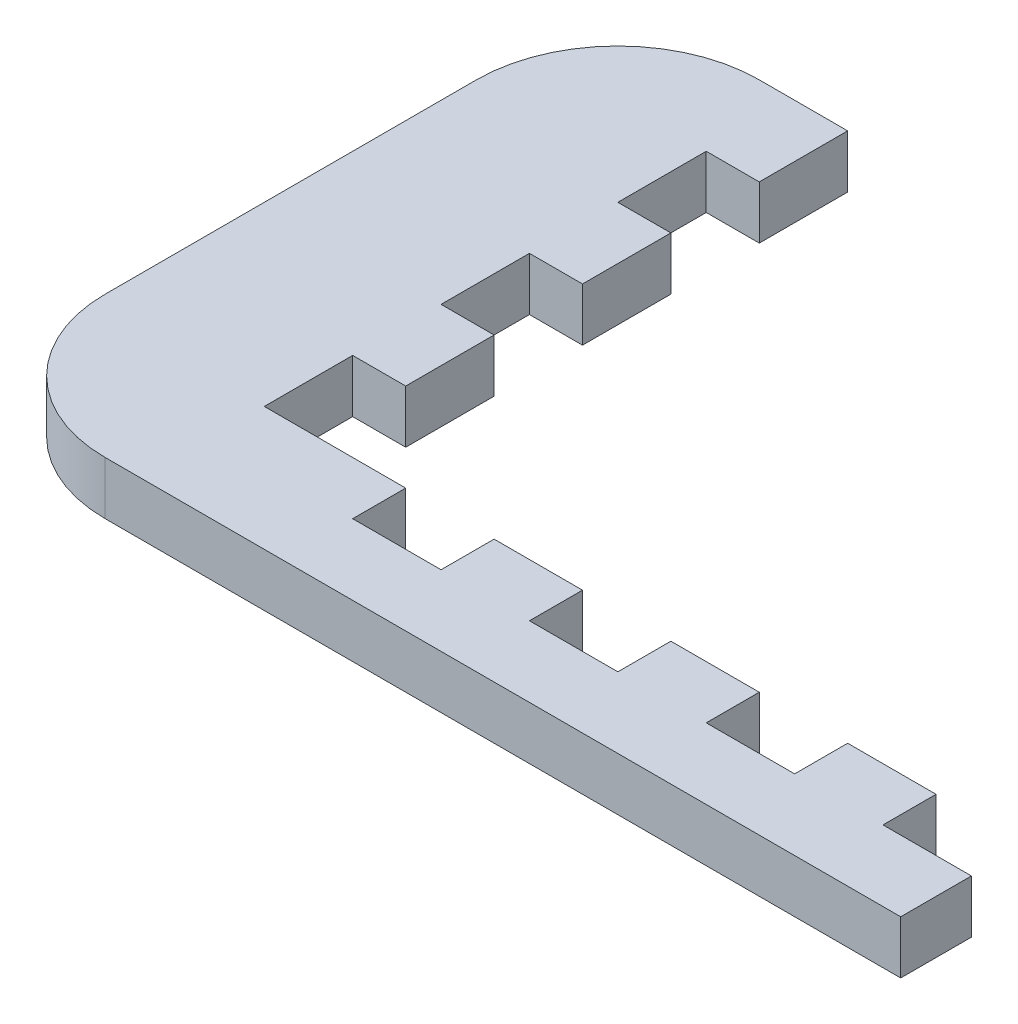
ISO-10303-21;
HEADER;
FILE_DESCRIPTION(('STEP AP214'),'2;1');
FILE_NAME('part.step','',(''),(''),'','','');
FILE_SCHEMA(('AUTOMOTIVE_DESIGN { 1 0 10303 214 1 1 1 1 }'));
ENDSEC;
DATA;
#1=APPLICATION_CONTEXT('core data for automotive mechanical design processes');
#2=APPLICATION_PROTOCOL_DEFINITION('international standard','automotive_design',2000,#1);
#3=PRODUCT_CONTEXT('',#1,'mechanical');
#4=PRODUCT('Part','Part','',(#3));
#5=PRODUCT_RELATED_PRODUCT_CATEGORY('part','',(#4));
#6=PRODUCT_DEFINITION_FORMATION('','',#4);
#7=PRODUCT_DEFINITION_CONTEXT('part definition',#1,'design');
#8=PRODUCT_DEFINITION('design','',#6,#7);
#9=PRODUCT_DEFINITION_SHAPE('','',#8);
#10=(LENGTH_UNIT() NAMED_UNIT(*) SI_UNIT(.MILLI.,.METRE.));
#11=(NAMED_UNIT(*) PLANE_ANGLE_UNIT() SI_UNIT($,.RADIAN.));
#12=(NAMED_UNIT(*) SI_UNIT($,.STERADIAN.) SOLID_ANGLE_UNIT());
#13=UNCERTAINTY_MEASURE_WITH_UNIT(LENGTH_MEASURE(1.E-05),#10,'distance_accuracy_value','');
#14=(GEOMETRIC_REPRESENTATION_CONTEXT(3) GLOBAL_UNCERTAINTY_ASSIGNED_CONTEXT((#13)) GLOBAL_UNIT_ASSIGNED_CONTEXT((#10,
#11,#12)) REPRESENTATION_CONTEXT('',''));
#15=CARTESIAN_POINT('',(0.,0.,0.));
#16=DIRECTION('',(0.,0.,1.));
#17=DIRECTION('',(1.,0.,0.));
#18=AXIS2_PLACEMENT_3D('',#15,#16,#17);
#19=CARTESIAN_POINT('',(24.,3.,-18.5));
#20=DIRECTION('',(-1.,0.,0.));
#21=DIRECTION('',(0.,0.,1.));
#22=AXIS2_PLACEMENT_3D('',#19,#20,#21);
#23=PLANE('',#22);
#24=DIRECTION('',(0.,1.,0.));
#25=VECTOR('',#24,1.);
#26=CARTESIAN_POINT('',(24.,3.,14.5));
#27=LINE('',#26,#25);
#28=CARTESIAN_POINT('',(24.,0.,14.5));
#29=VERTEX_POINT('',#28);
#30=CARTESIAN_POINT('',(24.,3.,14.5));
#31=VERTEX_POINT('',#30);
#32=EDGE_CURVE('E279',#29,#31,#27,.T.);
#33=ORIENTED_EDGE('',*,*,#32,.F.);
#34=DIRECTION('',(0.,0.,-1.));
#35=VECTOR('',#34,1.);
#36=CARTESIAN_POINT('',(24.,0.,-18.5));
#37=LINE('',#36,#35);
#38=CARTESIAN_POINT('',(24.,0.,11.5));
#39=VERTEX_POINT('',#38);
#40=EDGE_CURVE('E509',#29,#39,#37,.T.);
#41=ORIENTED_EDGE('',*,*,#40,.T.);
#42=DIRECTION('',(0.,1.,0.));
#43=VECTOR('',#42,1.);
#44=CARTESIAN_POINT('',(24.,-46.0977222864644,11.5));
#45=LINE('',#44,#43);
#46=CARTESIAN_POINT('',(24.,3.,11.5));
#47=VERTEX_POINT('',#46);
#48=EDGE_CURVE('E503',#39,#47,#45,.T.);
#49=ORIENTED_EDGE('',*,*,#48,.T.);
#50=DIRECTION('',(0.,0.,-1.));
#51=VECTOR('',#50,1.);
#52=CARTESIAN_POINT('',(24.,3.,-18.5));
#53=LINE('',#52,#51);
#54=EDGE_CURVE('E259',#31,#47,#53,.T.);
#55=ORIENTED_EDGE('',*,*,#54,.F.);
#56=EDGE_LOOP('',(#33,#41,#49,#55));
#57=FACE_BOUND('',#56,.T.);
#58=ADVANCED_FACE('F38',(#57),#23,.F.);
#59=CARTESIAN_POINT('',(24.,-46.0977222864644,11.5));
#60=DIRECTION('',(0.,0.,1.));
#61=DIRECTION('',(1.,0.,0.));
#62=AXIS2_PLACEMENT_3D('',#59,#60,#61);
#63=PLANE('',#62);
#64=DIRECTION('',(-1.,0.,0.));
#65=VECTOR('',#64,1.);
#66=CARTESIAN_POINT('',(24.,0.,11.5));
#67=LINE('',#66,#65);
#68=CARTESIAN_POINT('',(19.,0.,11.5));
#69=VERTEX_POINT('',#68);
#70=EDGE_CURVE('E505',#39,#69,#67,.T.);
#71=ORIENTED_EDGE('',*,*,#70,.T.);
#72=DIRECTION('',(0.,-1.,0.));
#73=VECTOR('',#72,1.);
#74=CARTESIAN_POINT('',(19.,0.,11.5));
#75=LINE('',#74,#73);
#76=CARTESIAN_POINT('',(19.,3.,11.5));
#77=VERTEX_POINT('',#76);
#78=EDGE_CURVE('E301',#77,#69,#75,.T.);
#79=ORIENTED_EDGE('',*,*,#78,.F.);
#80=DIRECTION('',(1.,0.,0.));
#81=VECTOR('',#80,1.);
#82=CARTESIAN_POINT('',(24.,3.,11.5));
#83=LINE('',#82,#81);
#84=EDGE_CURVE('E516',#77,#47,#83,.T.);
#85=ORIENTED_EDGE('',*,*,#84,.T.);
#86=ORIENTED_EDGE('',*,*,#48,.F.);
#87=EDGE_LOOP('',(#71,#79,#85,#86));
#88=FACE_BOUND('',#87,.T.);
#89=ADVANCED_FACE('F648',(#88),#63,.F.);
#90=CARTESIAN_POINT('',(9.,3.,11.5));
#91=VERTEX_POINT('',#90);
#92=CARTESIAN_POINT('',(14.,3.,11.5));
#93=VERTEX_POINT('',#92);
#94=EDGE_CURVE('E638',#91,#93,#83,.T.);
#95=ORIENTED_EDGE('',*,*,#94,.T.);
#96=DIRECTION('',(0.,1.,0.));
#97=VECTOR('',#96,1.);
#98=CARTESIAN_POINT('',(14.,0.,11.5));
#99=LINE('',#98,#97);
#100=CARTESIAN_POINT('',(14.,0.,11.5));
#101=VERTEX_POINT('',#100);
#102=EDGE_CURVE('E313',#101,#93,#99,.T.);
#103=ORIENTED_EDGE('',*,*,#102,.F.);
#104=CARTESIAN_POINT('',(9.,0.,11.5));
#105=VERTEX_POINT('',#104);
#106=EDGE_CURVE('E510',#101,#105,#67,.T.);
#107=ORIENTED_EDGE('',*,*,#106,.T.);
#108=DIRECTION('',(0.,-1.,0.));
#109=VECTOR('',#108,1.);
#110=CARTESIAN_POINT('',(9.,0.,11.5));
#111=LINE('',#110,#109);
#112=EDGE_CURVE('E338',#91,#105,#111,.T.);
#113=ORIENTED_EDGE('',*,*,#112,.F.);
#114=EDGE_LOOP('',(#95,#103,#107,#113));
#115=FACE_BOUND('',#114,.T.);
#116=ADVANCED_FACE('F623',(#115),#63,.F.);
#117=CARTESIAN_POINT('',(-1.,3.,11.5));
#118=VERTEX_POINT('',#117);
#119=CARTESIAN_POINT('',(4.,3.,11.5));
#120=VERTEX_POINT('',#119);
#121=EDGE_CURVE('E523',#118,#120,#83,.T.);
#122=ORIENTED_EDGE('',*,*,#121,.T.);
#123=DIRECTION('',(0.,1.,0.));
#124=VECTOR('',#123,1.);
#125=CARTESIAN_POINT('',(4.,0.,11.5));
#126=LINE('',#125,#124);
#127=CARTESIAN_POINT('',(4.,0.,11.5));
#128=VERTEX_POINT('',#127);
#129=EDGE_CURVE('E350',#128,#120,#126,.T.);
#130=ORIENTED_EDGE('',*,*,#129,.F.);
#131=CARTESIAN_POINT('',(-1.,0.,11.5));
#132=VERTEX_POINT('',#131);
#133=EDGE_CURVE('E605',#128,#132,#67,.T.);
#134=ORIENTED_EDGE('',*,*,#133,.T.);
#135=DIRECTION('',(0.,-1.,0.));
#136=VECTOR('',#135,1.);
#137=CARTESIAN_POINT('',(-1.,0.,11.5));
#138=LINE('',#137,#136);
#139=EDGE_CURVE('E373',#118,#132,#138,.T.);
#140=ORIENTED_EDGE('',*,*,#139,.F.);
#141=EDGE_LOOP('',(#122,#130,#134,#140));
#142=FACE_BOUND('',#141,.T.);
#143=ADVANCED_FACE('F679',(#142),#63,.F.);
#144=CARTESIAN_POINT('',(0.,3.,0.));
#145=DIRECTION('',(0.,1.,0.));
#146=DIRECTION('',(0.,0.,1.));
#147=AXIS2_PLACEMENT_3D('',#144,#145,#146);
#148=PLANE('',#147);
#149=DIRECTION('',(-1.,0.,0.));
#150=VECTOR('',#149,1.);
#151=CARTESIAN_POINT('',(-24.,3.,-18.5));
#152=LINE('',#151,#150);
#153=CARTESIAN_POINT('',(-11.,3.,-18.5));
#154=VERTEX_POINT('',#153);
#155=CARTESIAN_POINT('',(-16.,3.,-18.5));
#156=VERTEX_POINT('',#155);
#157=EDGE_CURVE('E531',#154,#156,#152,.T.);
#158=ORIENTED_EDGE('',*,*,#157,.T.);
#159=CARTESIAN_POINT('',(-16.,3.,-10.5));
#160=DIRECTION('',(0.,1.,0.));
#161=DIRECTION('',(0.,0.,1.));
#162=AXIS2_PLACEMENT_3D('',#159,#160,#161);
#163=CIRCLE('',#162,8.);
#164=CARTESIAN_POINT('',(-24.,3.,-10.5));
#165=VERTEX_POINT('',#164);
#166=EDGE_CURVE('E47',#156,#165,#163,.T.);
#167=ORIENTED_EDGE('',*,*,#166,.T.);
#168=DIRECTION('',(0.,0.,1.));
#169=VECTOR('',#168,1.);
#170=CARTESIAN_POINT('',(-24.,3.,-18.5));
#171=LINE('',#170,#169);
#172=CARTESIAN_POINT('',(-24.,3.,10.5));
#173=VERTEX_POINT('',#172);
#174=EDGE_CURVE('E534',#165,#173,#171,.T.);
#175=ORIENTED_EDGE('',*,*,#174,.T.);
#176=CARTESIAN_POINT('',(-16.,3.,10.5));
#177=DIRECTION('',(0.,1.,0.));
#178=DIRECTION('',(0.,0.,1.));
#179=AXIS2_PLACEMENT_3D('',#176,#177,#178);
#180=CIRCLE('',#179,8.);
#181=CARTESIAN_POINT('',(-16.,3.,18.5));
#182=VERTEX_POINT('',#181);
#183=EDGE_CURVE('E54',#173,#182,#180,.T.);
#184=ORIENTED_EDGE('',*,*,#183,.T.);
#185=DIRECTION('',(1.,0.,0.));
#186=VECTOR('',#185,1.);
#187=CARTESIAN_POINT('',(-24.,3.,18.5));
#188=LINE('',#187,#186);
#189=CARTESIAN_POINT('',(29.,3.,18.5));
#190=VERTEX_POINT('',#189);
#191=EDGE_CURVE('E537',#182,#190,#188,.T.);
#192=ORIENTED_EDGE('',*,*,#191,.T.);
#193=DIRECTION('',(0.,0.,1.));
#194=VECTOR('',#193,1.);
#195=CARTESIAN_POINT('',(29.,3.,18.5));
#196=LINE('',#195,#194);
#197=CARTESIAN_POINT('',(29.,3.,14.5));
#198=VERTEX_POINT('',#197);
#199=EDGE_CURVE('E277',#198,#190,#196,.T.);
#200=ORIENTED_EDGE('',*,*,#199,.F.);
#201=DIRECTION('',(-1.,0.,0.));
#202=VECTOR('',#201,1.);
#203=CARTESIAN_POINT('',(29.,3.,14.5));
#204=LINE('',#203,#202);
#205=EDGE_CURVE('E288',#198,#31,#204,.T.);
#206=ORIENTED_EDGE('',*,*,#205,.T.);
#207=ORIENTED_EDGE('',*,*,#54,.T.);
#208=ORIENTED_EDGE('',*,*,#84,.F.);
#209=DIRECTION('',(0.,0.,-1.));
#210=VECTOR('',#209,1.);
#211=CARTESIAN_POINT('',(19.,3.,14.5));
#212=LINE('',#211,#210);
#213=CARTESIAN_POINT('',(19.,3.,14.5));
#214=VERTEX_POINT('',#213);
#215=EDGE_CURVE('E324',#214,#77,#212,.T.);
#216=ORIENTED_EDGE('',*,*,#215,.F.);
#217=DIRECTION('',(1.,0.,0.));
#218=VECTOR('',#217,1.);
#219=CARTESIAN_POINT('',(0.,3.,14.5));
#220=LINE('',#219,#218);
#221=CARTESIAN_POINT('',(14.,3.,14.5));
#222=VERTEX_POINT('',#221);
#223=EDGE_CURVE('E305',#222,#214,#220,.T.);
#224=ORIENTED_EDGE('',*,*,#223,.F.);
#225=DIRECTION('',(0.,0.,-1.));
#226=VECTOR('',#225,1.);
#227=CARTESIAN_POINT('',(14.,3.,14.5));
#228=LINE('',#227,#226);
#229=EDGE_CURVE('E327',#222,#93,#228,.T.);
#230=ORIENTED_EDGE('',*,*,#229,.T.);
#231=ORIENTED_EDGE('',*,*,#94,.F.);
#232=DIRECTION('',(0.,0.,-1.));
#233=VECTOR('',#232,1.);
#234=CARTESIAN_POINT('',(9.,3.,14.5));
#235=LINE('',#234,#233);
#236=CARTESIAN_POINT('',(9.,3.,14.5));
#237=VERTEX_POINT('',#236);
#238=EDGE_CURVE('E359',#237,#91,#235,.T.);
#239=ORIENTED_EDGE('',*,*,#238,.F.);
#240=DIRECTION('',(1.,0.,0.));
#241=VECTOR('',#240,1.);
#242=CARTESIAN_POINT('',(0.,3.,14.5));
#243=LINE('',#242,#241);
#244=CARTESIAN_POINT('',(4.,3.,14.5));
#245=VERTEX_POINT('',#244);
#246=EDGE_CURVE('E342',#245,#237,#243,.T.);
#247=ORIENTED_EDGE('',*,*,#246,.F.);
#248=DIRECTION('',(0.,0.,-1.));
#249=VECTOR('',#248,1.);
#250=CARTESIAN_POINT('',(4.,3.,14.5));
#251=LINE('',#250,#249);
#252=EDGE_CURVE('E362',#245,#120,#251,.T.);
#253=ORIENTED_EDGE('',*,*,#252,.T.);
#254=ORIENTED_EDGE('',*,*,#121,.F.);
#255=DIRECTION('',(0.,0.,-1.));
#256=VECTOR('',#255,1.);
#257=CARTESIAN_POINT('',(-1.,3.,14.5));
#258=LINE('',#257,#256);
#259=CARTESIAN_POINT('',(-1.,3.,14.5));
#260=VERTEX_POINT('',#259);
#261=EDGE_CURVE('E392',#260,#118,#258,.T.);
#262=ORIENTED_EDGE('',*,*,#261,.F.);
#263=DIRECTION('',(1.,0.,0.));
#264=VECTOR('',#263,1.);
#265=CARTESIAN_POINT('',(0.,3.,14.5));
#266=LINE('',#265,#264);
#267=CARTESIAN_POINT('',(-6.,3.,14.5));
#268=VERTEX_POINT('',#267);
#269=EDGE_CURVE('E377',#268,#260,#266,.T.);
#270=ORIENTED_EDGE('',*,*,#269,.F.);
#271=DIRECTION('',(0.,0.,-1.));
#272=VECTOR('',#271,1.);
#273=CARTESIAN_POINT('',(-6.,3.,14.5));
#274=LINE('',#273,#272);
#275=CARTESIAN_POINT('',(-6.,3.,11.5));
#276=VERTEX_POINT('',#275);
#277=EDGE_CURVE('E395',#268,#276,#274,.T.);
#278=ORIENTED_EDGE('',*,*,#277,.T.);
#279=CARTESIAN_POINT('',(-14.,3.,11.5));
#280=VERTEX_POINT('',#279);
#281=EDGE_CURVE('E518',#280,#276,#83,.T.);
#282=ORIENTED_EDGE('',*,*,#281,.F.);
#283=DIRECTION('',(0.,0.,1.));
#284=VECTOR('',#283,1.);
#285=CARTESIAN_POINT('',(-14.,3.,0.));
#286=LINE('',#285,#284);
#287=CARTESIAN_POINT('',(-14.,3.,6.50000000000002));
#288=VERTEX_POINT('',#287);
#289=EDGE_CURVE('E478',#288,#280,#286,.T.);
#290=ORIENTED_EDGE('',*,*,#289,.F.);
#291=DIRECTION('',(1.,0.,0.));
#292=VECTOR('',#291,1.);
#293=CARTESIAN_POINT('',(-14.,3.,6.50000000000002));
#294=LINE('',#293,#292);
#295=CARTESIAN_POINT('',(-11.,3.,6.50000000000002));
#296=VERTEX_POINT('',#295);
#297=EDGE_CURVE('E490',#288,#296,#294,.T.);
#298=ORIENTED_EDGE('',*,*,#297,.T.);
#299=DIRECTION('',(0.,0.,1.));
#300=VECTOR('',#299,1.);
#301=CARTESIAN_POINT('',(-11.,3.,-18.5));
#302=LINE('',#301,#300);
#303=CARTESIAN_POINT('',(-11.,3.,1.50000000000002));
#304=VERTEX_POINT('',#303);
#305=EDGE_CURVE('E428',#304,#296,#302,.T.);
#306=ORIENTED_EDGE('',*,*,#305,.F.);
#307=DIRECTION('',(1.,0.,0.));
#308=VECTOR('',#307,1.);
#309=CARTESIAN_POINT('',(-14.,3.,1.50000000000002));
#310=LINE('',#309,#308);
#311=CARTESIAN_POINT('',(-14.,3.,1.50000000000002));
#312=VERTEX_POINT('',#311);
#313=EDGE_CURVE('E421',#312,#304,#310,.T.);
#314=ORIENTED_EDGE('',*,*,#313,.F.);
#315=DIRECTION('',(0.,0.,1.));
#316=VECTOR('',#315,1.);
#317=CARTESIAN_POINT('',(-14.,3.,0.));
#318=LINE('',#317,#316);
#319=CARTESIAN_POINT('',(-14.,3.,-3.49999999999998));
#320=VERTEX_POINT('',#319);
#321=EDGE_CURVE('E450',#320,#312,#318,.T.);
#322=ORIENTED_EDGE('',*,*,#321,.F.);
#323=DIRECTION('',(1.,0.,0.));
#324=VECTOR('',#323,1.);
#325=CARTESIAN_POINT('',(-14.,3.,-3.49999999999998));
#326=LINE('',#325,#324);
#327=CARTESIAN_POINT('',(-11.,3.,-3.49999999999999));
#328=VERTEX_POINT('',#327);
#329=EDGE_CURVE('E465',#320,#328,#326,.T.);
#330=ORIENTED_EDGE('',*,*,#329,.T.);
#331=CARTESIAN_POINT('',(-11.,3.,-8.49999999999999));
#332=VERTEX_POINT('',#331);
#333=EDGE_CURVE('E517',#332,#328,#302,.T.);
#334=ORIENTED_EDGE('',*,*,#333,.F.);
#335=DIRECTION('',(1.,0.,0.));
#336=VECTOR('',#335,1.);
#337=CARTESIAN_POINT('',(-14.,3.,-8.49999999999999));
#338=LINE('',#337,#336);
#339=CARTESIAN_POINT('',(-14.,3.,-8.49999999999999));
#340=VERTEX_POINT('',#339);
#341=EDGE_CURVE('E425',#340,#332,#338,.T.);
#342=ORIENTED_EDGE('',*,*,#341,.F.);
#343=DIRECTION('',(0.,0.,1.));
#344=VECTOR('',#343,1.);
#345=CARTESIAN_POINT('',(-14.,3.,0.));
#346=LINE('',#345,#344);
#347=CARTESIAN_POINT('',(-14.,3.,-13.5));
#348=VERTEX_POINT('',#347);
#349=EDGE_CURVE('E412',#348,#340,#346,.T.);
#350=ORIENTED_EDGE('',*,*,#349,.F.);
#351=DIRECTION('',(1.,0.,0.));
#352=VECTOR('',#351,1.);
#353=CARTESIAN_POINT('',(-14.,3.,-13.5));
#354=LINE('',#353,#352);
#355=CARTESIAN_POINT('',(-11.,3.,-13.5));
#356=VERTEX_POINT('',#355);
#357=EDGE_CURVE('E429',#348,#356,#354,.T.);
#358=ORIENTED_EDGE('',*,*,#357,.T.);
#359=EDGE_CURVE('E512',#154,#356,#302,.T.);
#360=ORIENTED_EDGE('',*,*,#359,.F.);
#361=EDGE_LOOP('',(#158,#167,#175,#184,#192,#200,#206,#207,#208,#216,#224,#230,#231,#239,#247,
#253,#254,#262,#270,#278,#282,#290,#298,#306,#314,#322,#330,#334,#342,#350,#358,#360));
#362=FACE_BOUND('',#361,.T.);
#363=ADVANCED_FACE('F567',(#362),#148,.T.);
#364=CARTESIAN_POINT('',(0.,0.,0.));
#365=DIRECTION('',(0.,1.,0.));
#366=DIRECTION('',(0.,0.,1.));
#367=AXIS2_PLACEMENT_3D('',#364,#365,#366);
#368=PLANE('',#367);
#369=DIRECTION('',(0.,0.,1.));
#370=VECTOR('',#369,1.);
#371=CARTESIAN_POINT('',(-24.,0.,-18.5));
#372=LINE('',#371,#370);
#373=CARTESIAN_POINT('',(-24.,0.,-10.5));
#374=VERTEX_POINT('',#373);
#375=CARTESIAN_POINT('',(-24.,0.,10.5));
#376=VERTEX_POINT('',#375);
#377=EDGE_CURVE('E260',#374,#376,#372,.T.);
#378=ORIENTED_EDGE('',*,*,#377,.F.);
#379=CARTESIAN_POINT('',(-16.,0.,-10.5));
#380=DIRECTION('',(0.,1.,0.));
#381=DIRECTION('',(0.,0.,1.));
#382=AXIS2_PLACEMENT_3D('',#379,#380,#381);
#383=CIRCLE('',#382,8.);
#384=CARTESIAN_POINT('',(-16.,0.,-18.5));
#385=VERTEX_POINT('',#384);
#386=EDGE_CURVE('E558',#374,#385,#383,.F.);
#387=ORIENTED_EDGE('',*,*,#386,.T.);
#388=DIRECTION('',(-1.,0.,0.));
#389=VECTOR('',#388,1.);
#390=CARTESIAN_POINT('',(-24.,0.,-18.5));
#391=LINE('',#390,#389);
#392=CARTESIAN_POINT('',(-11.,0.,-18.5));
#393=VERTEX_POINT('',#392);
#394=EDGE_CURVE('E543',#393,#385,#391,.T.);
#395=ORIENTED_EDGE('',*,*,#394,.F.);
#396=DIRECTION('',(0.,0.,-1.));
#397=VECTOR('',#396,1.);
#398=CARTESIAN_POINT('',(-11.,0.,-18.5));
#399=LINE('',#398,#397);
#400=CARTESIAN_POINT('',(-11.,0.,-13.5));
#401=VERTEX_POINT('',#400);
#402=EDGE_CURVE('E499',#401,#393,#399,.T.);
#403=ORIENTED_EDGE('',*,*,#402,.F.);
#404=DIRECTION('',(1.,0.,0.));
#405=VECTOR('',#404,1.);
#406=CARTESIAN_POINT('',(-14.,0.,-13.5));
#407=LINE('',#406,#405);
#408=CARTESIAN_POINT('',(-14.,0.,-13.5));
#409=VERTEX_POINT('',#408);
#410=EDGE_CURVE('E433',#409,#401,#407,.T.);
#411=ORIENTED_EDGE('',*,*,#410,.F.);
#412=DIRECTION('',(0.,0.,-1.));
#413=VECTOR('',#412,1.);
#414=CARTESIAN_POINT('',(-14.,0.,0.));
#415=LINE('',#414,#413);
#416=CARTESIAN_POINT('',(-14.,0.,-8.49999999999999));
#417=VERTEX_POINT('',#416);
#418=EDGE_CURVE('E404',#417,#409,#415,.T.);
#419=ORIENTED_EDGE('',*,*,#418,.F.);
#420=DIRECTION('',(1.,0.,0.));
#421=VECTOR('',#420,1.);
#422=CARTESIAN_POINT('',(-14.,0.,-8.49999999999999));
#423=LINE('',#422,#421);
#424=CARTESIAN_POINT('',(-11.,0.,-8.49999999999999));
#425=VERTEX_POINT('',#424);
#426=EDGE_CURVE('E416',#417,#425,#423,.T.);
#427=ORIENTED_EDGE('',*,*,#426,.T.);
#428=CARTESIAN_POINT('',(-11.,0.,-3.49999999999999));
#429=VERTEX_POINT('',#428);
#430=EDGE_CURVE('E502',#429,#425,#399,.T.);
#431=ORIENTED_EDGE('',*,*,#430,.F.);
#432=DIRECTION('',(1.,0.,0.));
#433=VECTOR('',#432,1.);
#434=CARTESIAN_POINT('',(-14.,0.,-3.49999999999998));
#435=LINE('',#434,#433);
#436=CARTESIAN_POINT('',(-14.,0.,-3.49999999999998));
#437=VERTEX_POINT('',#436);
#438=EDGE_CURVE('E469',#437,#429,#435,.T.);
#439=ORIENTED_EDGE('',*,*,#438,.F.);
#440=DIRECTION('',(0.,0.,-1.));
#441=VECTOR('',#440,1.);
#442=CARTESIAN_POINT('',(-14.,0.,0.));
#443=LINE('',#442,#441);
#444=CARTESIAN_POINT('',(-14.,0.,1.50000000000002));
#445=VERTEX_POINT('',#444);
#446=EDGE_CURVE('E442',#445,#437,#443,.T.);
#447=ORIENTED_EDGE('',*,*,#446,.F.);
#448=DIRECTION('',(1.,0.,0.));
#449=VECTOR('',#448,1.);
#450=CARTESIAN_POINT('',(-14.,0.,1.50000000000002));
#451=LINE('',#450,#449);
#452=CARTESIAN_POINT('',(-11.,0.,1.50000000000002));
#453=VERTEX_POINT('',#452);
#454=EDGE_CURVE('E454',#445,#453,#451,.T.);
#455=ORIENTED_EDGE('',*,*,#454,.T.);
#456=CARTESIAN_POINT('',(-11.,0.,6.50000000000002));
#457=VERTEX_POINT('',#456);
#458=EDGE_CURVE('E504',#457,#453,#399,.T.);
#459=ORIENTED_EDGE('',*,*,#458,.F.);
#460=DIRECTION('',(1.,0.,0.));
#461=VECTOR('',#460,1.);
#462=CARTESIAN_POINT('',(-14.,0.,6.50000000000002));
#463=LINE('',#462,#461);
#464=CARTESIAN_POINT('',(-14.,0.,6.50000000000002));
#465=VERTEX_POINT('',#464);
#466=EDGE_CURVE('E459',#465,#457,#463,.T.);
#467=ORIENTED_EDGE('',*,*,#466,.F.);
#468=DIRECTION('',(0.,0.,-1.));
#469=VECTOR('',#468,1.);
#470=CARTESIAN_POINT('',(-14.,0.,0.));
#471=LINE('',#470,#469);
#472=CARTESIAN_POINT('',(-14.,0.,11.5));
#473=VERTEX_POINT('',#472);
#474=EDGE_CURVE('E486',#473,#465,#471,.T.);
#475=ORIENTED_EDGE('',*,*,#474,.F.);
#476=CARTESIAN_POINT('',(-6.,0.,11.5));
#477=VERTEX_POINT('',#476);
#478=EDGE_CURVE('E511',#477,#473,#67,.T.);
#479=ORIENTED_EDGE('',*,*,#478,.F.);
#480=DIRECTION('',(0.,0.,-1.));
#481=VECTOR('',#480,1.);
#482=CARTESIAN_POINT('',(-6.,0.,14.5));
#483=LINE('',#482,#481);
#484=CARTESIAN_POINT('',(-6.,0.,14.5));
#485=VERTEX_POINT('',#484);
#486=EDGE_CURVE('E384',#485,#477,#483,.T.);
#487=ORIENTED_EDGE('',*,*,#486,.F.);
#488=DIRECTION('',(-1.,0.,0.));
#489=VECTOR('',#488,1.);
#490=CARTESIAN_POINT('',(0.,0.,14.5));
#491=LINE('',#490,#489);
#492=CARTESIAN_POINT('',(-1.,0.,14.5));
#493=VERTEX_POINT('',#492);
#494=EDGE_CURVE('E368',#493,#485,#491,.T.);
#495=ORIENTED_EDGE('',*,*,#494,.F.);
#496=DIRECTION('',(0.,0.,-1.));
#497=VECTOR('',#496,1.);
#498=CARTESIAN_POINT('',(-1.,0.,14.5));
#499=LINE('',#498,#497);
#500=EDGE_CURVE('E353',#493,#132,#499,.T.);
#501=ORIENTED_EDGE('',*,*,#500,.T.);
#502=ORIENTED_EDGE('',*,*,#133,.F.);
#503=DIRECTION('',(0.,0.,-1.));
#504=VECTOR('',#503,1.);
#505=CARTESIAN_POINT('',(4.,0.,14.5));
#506=LINE('',#505,#504);
#507=CARTESIAN_POINT('',(4.,0.,14.5));
#508=VERTEX_POINT('',#507);
#509=EDGE_CURVE('E349',#508,#128,#506,.T.);
#510=ORIENTED_EDGE('',*,*,#509,.F.);
#511=DIRECTION('',(-1.,0.,0.));
#512=VECTOR('',#511,1.);
#513=CARTESIAN_POINT('',(0.,0.,14.5));
#514=LINE('',#513,#512);
#515=CARTESIAN_POINT('',(9.,0.,14.5));
#516=VERTEX_POINT('',#515);
#517=EDGE_CURVE('E333',#516,#508,#514,.T.);
#518=ORIENTED_EDGE('',*,*,#517,.F.);
#519=DIRECTION('',(0.,0.,-1.));
#520=VECTOR('',#519,1.);
#521=CARTESIAN_POINT('',(9.,0.,14.5));
#522=LINE('',#521,#520);
#523=EDGE_CURVE('E316',#516,#105,#522,.T.);
#524=ORIENTED_EDGE('',*,*,#523,.T.);
#525=ORIENTED_EDGE('',*,*,#106,.F.);
#526=DIRECTION('',(0.,0.,-1.));
#527=VECTOR('',#526,1.);
#528=CARTESIAN_POINT('',(14.,0.,14.5));
#529=LINE('',#528,#527);
#530=CARTESIAN_POINT('',(14.,0.,14.5));
#531=VERTEX_POINT('',#530);
#532=EDGE_CURVE('E312',#531,#101,#529,.T.);
#533=ORIENTED_EDGE('',*,*,#532,.F.);
#534=DIRECTION('',(-1.,0.,0.));
#535=VECTOR('',#534,1.);
#536=CARTESIAN_POINT('',(0.,0.,14.5));
#537=LINE('',#536,#535);
#538=CARTESIAN_POINT('',(19.,0.,14.5));
#539=VERTEX_POINT('',#538);
#540=EDGE_CURVE('E296',#539,#531,#537,.T.);
#541=ORIENTED_EDGE('',*,*,#540,.F.);
#542=DIRECTION('',(0.,0.,-1.));
#543=VECTOR('',#542,1.);
#544=CARTESIAN_POINT('',(19.,0.,14.5));
#545=LINE('',#544,#543);
#546=EDGE_CURVE('E319',#539,#69,#545,.T.);
#547=ORIENTED_EDGE('',*,*,#546,.T.);
#548=ORIENTED_EDGE('',*,*,#70,.F.);
#549=ORIENTED_EDGE('',*,*,#40,.F.);
#550=DIRECTION('',(-1.,0.,0.));
#551=VECTOR('',#550,1.);
#552=CARTESIAN_POINT('',(29.,0.,14.5));
#553=LINE('',#552,#551);
#554=CARTESIAN_POINT('',(29.,0.,14.5));
#555=VERTEX_POINT('',#554);
#556=EDGE_CURVE('E268',#555,#29,#553,.T.);
#557=ORIENTED_EDGE('',*,*,#556,.F.);
#558=DIRECTION('',(0.,0.,-1.));
#559=VECTOR('',#558,1.);
#560=CARTESIAN_POINT('',(29.,0.,18.5));
#561=LINE('',#560,#559);
#562=CARTESIAN_POINT('',(29.,0.,18.5));
#563=VERTEX_POINT('',#562);
#564=EDGE_CURVE('E263',#563,#555,#561,.T.);
#565=ORIENTED_EDGE('',*,*,#564,.F.);
#566=DIRECTION('',(1.,0.,0.));
#567=VECTOR('',#566,1.);
#568=CARTESIAN_POINT('',(-24.,0.,18.5));
#569=LINE('',#568,#567);
#570=CARTESIAN_POINT('',(-16.,0.,18.5));
#571=VERTEX_POINT('',#570);
#572=EDGE_CURVE('E251',#571,#563,#569,.T.);
#573=ORIENTED_EDGE('',*,*,#572,.F.);
#574=CARTESIAN_POINT('',(-16.,0.,10.5));
#575=DIRECTION('',(0.,1.,0.));
#576=DIRECTION('',(0.,0.,1.));
#577=AXIS2_PLACEMENT_3D('',#574,#575,#576);
#578=CIRCLE('',#577,8.);
#579=EDGE_CURVE('E555',#571,#376,#578,.F.);
#580=ORIENTED_EDGE('',*,*,#579,.T.);
#581=EDGE_LOOP('',(#378,#387,#395,#403,#411,#419,#427,#431,#439,#447,#455,#459,#467,#475,#479,
#487,#495,#501,#502,#510,#518,#524,#525,#533,#541,#547,#548,#549,#557,#565,#573,#580));
#582=FACE_BOUND('',#581,.T.);
#583=ADVANCED_FACE('F265',(#582),#368,.F.);
#584=CARTESIAN_POINT('',(-11.,-46.0977222864644,-18.5));
#585=DIRECTION('',(-1.,0.,0.));
#586=DIRECTION('',(0.,0.,1.));
#587=AXIS2_PLACEMENT_3D('',#584,#585,#586);
#588=PLANE('',#587);
#589=DIRECTION('',(0.,1.,0.));
#590=VECTOR('',#589,1.);
#591=CARTESIAN_POINT('',(-11.,0.,-8.49999999999999));
#592=LINE('',#591,#590);
#593=EDGE_CURVE('E417',#425,#332,#592,.T.);
#594=ORIENTED_EDGE('',*,*,#593,.T.);
#595=ORIENTED_EDGE('',*,*,#333,.T.);
#596=DIRECTION('',(0.,-1.,0.));
#597=VECTOR('',#596,1.);
#598=CARTESIAN_POINT('',(-11.,0.,-3.49999999999999));
#599=LINE('',#598,#597);
#600=EDGE_CURVE('E443',#328,#429,#599,.T.);
#601=ORIENTED_EDGE('',*,*,#600,.T.);
#602=ORIENTED_EDGE('',*,*,#430,.T.);
#603=EDGE_LOOP('',(#594,#595,#601,#602));
#604=FACE_BOUND('',#603,.T.);
#605=ADVANCED_FACE('F596',(#604),#588,.F.);
#606=DIRECTION('',(0.,-1.,0.));
#607=VECTOR('',#606,1.);
#608=CARTESIAN_POINT('',(-11.,0.,-13.5));
#609=LINE('',#608,#607);
#610=EDGE_CURVE('E405',#356,#401,#609,.T.);
#611=ORIENTED_EDGE('',*,*,#610,.T.);
#612=ORIENTED_EDGE('',*,*,#402,.T.);
#613=DIRECTION('',(0.,1.,0.));
#614=VECTOR('',#613,1.);
#615=CARTESIAN_POINT('',(-11.,-46.0977222864644,-18.5));
#616=LINE('',#615,#614);
#617=EDGE_CURVE('E522',#393,#154,#616,.T.);
#618=ORIENTED_EDGE('',*,*,#617,.T.);
#619=ORIENTED_EDGE('',*,*,#359,.T.);
#620=EDGE_LOOP('',(#611,#612,#618,#619));
#621=FACE_BOUND('',#620,.T.);
#622=ADVANCED_FACE('F580',(#621),#588,.F.);
#623=DIRECTION('',(0.,1.,0.));
#624=VECTOR('',#623,1.);
#625=CARTESIAN_POINT('',(-11.,0.,1.50000000000002));
#626=LINE('',#625,#624);
#627=EDGE_CURVE('E455',#453,#304,#626,.T.);
#628=ORIENTED_EDGE('',*,*,#627,.T.);
#629=ORIENTED_EDGE('',*,*,#305,.T.);
#630=DIRECTION('',(0.,-1.,0.));
#631=VECTOR('',#630,1.);
#632=CARTESIAN_POINT('',(-11.,0.,6.50000000000002));
#633=LINE('',#632,#631);
#634=EDGE_CURVE('E323',#296,#457,#633,.T.);
#635=ORIENTED_EDGE('',*,*,#634,.T.);
#636=ORIENTED_EDGE('',*,*,#458,.T.);
#637=EDGE_LOOP('',(#628,#629,#635,#636));
#638=FACE_BOUND('',#637,.T.);
#639=ADVANCED_FACE('F670',(#638),#588,.F.);
#640=CARTESIAN_POINT('',(-24.,3.,-18.5));
#641=DIRECTION('',(0.,0.,1.));
#642=DIRECTION('',(1.,0.,0.));
#643=AXIS2_PLACEMENT_3D('',#640,#641,#642);
#644=PLANE('',#643);
#645=ORIENTED_EDGE('',*,*,#394,.T.);
#646=DIRECTION('',(0.,-1.,0.));
#647=VECTOR('',#646,1.);
#648=CARTESIAN_POINT('',(-16.,3.,-18.5));
#649=LINE('',#648,#647);
#650=EDGE_CURVE('E62',#385,#156,#649,.F.);
#651=ORIENTED_EDGE('',*,*,#650,.T.);
#652=ORIENTED_EDGE('',*,*,#157,.F.);
#653=ORIENTED_EDGE('',*,*,#617,.F.);
#654=EDGE_LOOP('',(#645,#651,#652,#653));
#655=FACE_BOUND('',#654,.T.);
#656=ADVANCED_FACE('F578',(#655),#644,.F.);
#657=CARTESIAN_POINT('',(-24.,3.,-18.5));
#658=DIRECTION('',(1.,0.,0.));
#659=DIRECTION('',(0.,0.,-1.));
#660=AXIS2_PLACEMENT_3D('',#657,#658,#659);
#661=PLANE('',#660);
#662=ORIENTED_EDGE('',*,*,#174,.F.);
#663=DIRECTION('',(0.,-1.,0.));
#664=VECTOR('',#663,1.);
#665=CARTESIAN_POINT('',(-24.,3.,-10.5));
#666=LINE('',#665,#664);
#667=EDGE_CURVE('E551',#165,#374,#666,.T.);
#668=ORIENTED_EDGE('',*,*,#667,.T.);
#669=ORIENTED_EDGE('',*,*,#377,.T.);
#670=DIRECTION('',(0.,-1.,0.));
#671=VECTOR('',#670,1.);
#672=CARTESIAN_POINT('',(-24.,3.,10.5));
#673=LINE('',#672,#671);
#674=EDGE_CURVE('E540',#376,#173,#673,.F.);
#675=ORIENTED_EDGE('',*,*,#674,.T.);
#676=EDGE_LOOP('',(#662,#668,#669,#675));
#677=FACE_BOUND('',#676,.T.);
#678=ADVANCED_FACE('F572',(#677),#661,.F.);
#679=CARTESIAN_POINT('',(-24.,3.,18.5));
#680=DIRECTION('',(0.,0.,-1.));
#681=DIRECTION('',(-1.,0.,0.));
#682=AXIS2_PLACEMENT_3D('',#679,#680,#681);
#683=PLANE('',#682);
#684=ORIENTED_EDGE('',*,*,#191,.F.);
#685=DIRECTION('',(0.,-1.,0.));
#686=VECTOR('',#685,1.);
#687=CARTESIAN_POINT('',(-16.,3.,18.5));
#688=LINE('',#687,#686);
#689=EDGE_CURVE('E11',#182,#571,#688,.T.);
#690=ORIENTED_EDGE('',*,*,#689,.T.);
#691=ORIENTED_EDGE('',*,*,#572,.T.);
#692=DIRECTION('',(0.,-1.,0.));
#693=VECTOR('',#692,1.);
#694=CARTESIAN_POINT('',(29.,3.,18.5));
#695=LINE('',#694,#693);
#696=EDGE_CURVE('E255',#190,#563,#695,.T.);
#697=ORIENTED_EDGE('',*,*,#696,.F.);
#698=EDGE_LOOP('',(#684,#690,#691,#697));
#699=FACE_BOUND('',#698,.T.);
#700=ADVANCED_FACE('F253',(#699),#683,.F.);
#701=ORIENTED_EDGE('',*,*,#281,.T.);
#702=DIRECTION('',(0.,1.,0.));
#703=VECTOR('',#702,1.);
#704=CARTESIAN_POINT('',(-6.,0.,11.5));
#705=LINE('',#704,#703);
#706=EDGE_CURVE('E295',#477,#276,#705,.T.);
#707=ORIENTED_EDGE('',*,*,#706,.F.);
#708=ORIENTED_EDGE('',*,*,#478,.T.);
#709=DIRECTION('',(0.,-1.,0.));
#710=VECTOR('',#709,1.);
#711=CARTESIAN_POINT('',(-14.,0.,11.5));
#712=LINE('',#711,#710);
#713=EDGE_CURVE('E482',#280,#473,#712,.T.);
#714=ORIENTED_EDGE('',*,*,#713,.F.);
#715=EDGE_LOOP('',(#701,#707,#708,#714));
#716=FACE_BOUND('',#715,.T.);
#717=ADVANCED_FACE('F666',(#716),#63,.F.);
#718=CARTESIAN_POINT('',(-14.,0.,6.50000000000002));
#719=DIRECTION('',(0.,0.,1.));
#720=DIRECTION('',(1.,0.,0.));
#721=AXIS2_PLACEMENT_3D('',#718,#719,#720);
#722=PLANE('',#721);
#723=ORIENTED_EDGE('',*,*,#634,.F.);
#724=ORIENTED_EDGE('',*,*,#297,.F.);
#725=DIRECTION('',(0.,-1.,0.));
#726=VECTOR('',#725,1.);
#727=CARTESIAN_POINT('',(-14.,0.,6.50000000000002));
#728=LINE('',#727,#726);
#729=EDGE_CURVE('E475',#288,#465,#728,.T.);
#730=ORIENTED_EDGE('',*,*,#729,.T.);
#731=ORIENTED_EDGE('',*,*,#466,.T.);
#732=EDGE_LOOP('',(#723,#724,#730,#731));
#733=FACE_BOUND('',#732,.T.);
#734=ADVANCED_FACE('F683',(#733),#722,.T.);
#735=CARTESIAN_POINT('',(-14.,0.,0.));
#736=DIRECTION('',(1.,0.,0.));
#737=DIRECTION('',(0.,0.,-1.));
#738=AXIS2_PLACEMENT_3D('',#735,#736,#737);
#739=PLANE('',#738);
#740=ORIENTED_EDGE('',*,*,#729,.F.);
#741=ORIENTED_EDGE('',*,*,#289,.T.);
#742=ORIENTED_EDGE('',*,*,#713,.T.);
#743=ORIENTED_EDGE('',*,*,#474,.T.);
#744=EDGE_LOOP('',(#740,#741,#742,#743));
#745=FACE_BOUND('',#744,.T.);
#746=ADVANCED_FACE('F686',(#745),#739,.T.);
#747=CARTESIAN_POINT('',(-14.,0.,1.50000000000002));
#748=DIRECTION('',(0.,0.,-1.));
#749=DIRECTION('',(-1.,0.,0.));
#750=AXIS2_PLACEMENT_3D('',#747,#748,#749);
#751=PLANE('',#750);
#752=ORIENTED_EDGE('',*,*,#627,.F.);
#753=ORIENTED_EDGE('',*,*,#454,.F.);
#754=DIRECTION('',(0.,1.,0.));
#755=VECTOR('',#754,1.);
#756=CARTESIAN_POINT('',(-14.,0.,1.50000000000002));
#757=LINE('',#756,#755);
#758=EDGE_CURVE('E439',#445,#312,#757,.T.);
#759=ORIENTED_EDGE('',*,*,#758,.T.);
#760=ORIENTED_EDGE('',*,*,#313,.T.);
#761=EDGE_LOOP('',(#752,#753,#759,#760));
#762=FACE_BOUND('',#761,.T.);
#763=ADVANCED_FACE('F690',(#762),#751,.T.);
#764=CARTESIAN_POINT('',(-14.,0.,-3.49999999999998));
#765=DIRECTION('',(0.,0.,1.));
#766=DIRECTION('',(1.,0.,0.));
#767=AXIS2_PLACEMENT_3D('',#764,#765,#766);
#768=PLANE('',#767);
#769=ORIENTED_EDGE('',*,*,#600,.F.);
#770=ORIENTED_EDGE('',*,*,#329,.F.);
#771=DIRECTION('',(0.,-1.,0.));
#772=VECTOR('',#771,1.);
#773=CARTESIAN_POINT('',(-14.,0.,-3.49999999999998));
#774=LINE('',#773,#772);
#775=EDGE_CURVE('E447',#320,#437,#774,.T.);
#776=ORIENTED_EDGE('',*,*,#775,.T.);
#777=ORIENTED_EDGE('',*,*,#438,.T.);
#778=EDGE_LOOP('',(#769,#770,#776,#777));
#779=FACE_BOUND('',#778,.T.);
#780=ADVANCED_FACE('F694',(#779),#768,.T.);
#781=CARTESIAN_POINT('',(-14.,0.,0.));
#782=DIRECTION('',(1.,0.,0.));
#783=DIRECTION('',(0.,0.,-1.));
#784=AXIS2_PLACEMENT_3D('',#781,#782,#783);
#785=PLANE('',#784);
#786=ORIENTED_EDGE('',*,*,#758,.F.);
#787=ORIENTED_EDGE('',*,*,#446,.T.);
#788=ORIENTED_EDGE('',*,*,#775,.F.);
#789=ORIENTED_EDGE('',*,*,#321,.T.);
#790=EDGE_LOOP('',(#786,#787,#788,#789));
#791=FACE_BOUND('',#790,.T.);
#792=ADVANCED_FACE('F698',(#791),#785,.T.);
#793=CARTESIAN_POINT('',(-14.,0.,-8.49999999999999));
#794=DIRECTION('',(0.,0.,-1.));
#795=DIRECTION('',(-1.,0.,0.));
#796=AXIS2_PLACEMENT_3D('',#793,#794,#795);
#797=PLANE('',#796);
#798=ORIENTED_EDGE('',*,*,#593,.F.);
#799=ORIENTED_EDGE('',*,*,#426,.F.);
#800=DIRECTION('',(0.,1.,0.));
#801=VECTOR('',#800,1.);
#802=CARTESIAN_POINT('',(-14.,0.,-8.49999999999999));
#803=LINE('',#802,#801);
#804=EDGE_CURVE('E401',#417,#340,#803,.T.);
#805=ORIENTED_EDGE('',*,*,#804,.T.);
#806=ORIENTED_EDGE('',*,*,#341,.T.);
#807=EDGE_LOOP('',(#798,#799,#805,#806));
#808=FACE_BOUND('',#807,.T.);
#809=ADVANCED_FACE('F702',(#808),#797,.T.);
#810=CARTESIAN_POINT('',(-14.,0.,-13.5));
#811=DIRECTION('',(0.,0.,1.));
#812=DIRECTION('',(1.,0.,0.));
#813=AXIS2_PLACEMENT_3D('',#810,#811,#812);
#814=PLANE('',#813);
#815=ORIENTED_EDGE('',*,*,#610,.F.);
#816=ORIENTED_EDGE('',*,*,#357,.F.);
#817=DIRECTION('',(0.,-1.,0.));
#818=VECTOR('',#817,1.);
#819=CARTESIAN_POINT('',(-14.,0.,-13.5));
#820=LINE('',#819,#818);
#821=EDGE_CURVE('E409',#348,#409,#820,.T.);
#822=ORIENTED_EDGE('',*,*,#821,.T.);
#823=ORIENTED_EDGE('',*,*,#410,.T.);
#824=EDGE_LOOP('',(#815,#816,#822,#823));
#825=FACE_BOUND('',#824,.T.);
#826=ADVANCED_FACE('F585',(#825),#814,.T.);
#827=CARTESIAN_POINT('',(-14.,0.,0.));
#828=DIRECTION('',(1.,0.,0.));
#829=DIRECTION('',(0.,0.,-1.));
#830=AXIS2_PLACEMENT_3D('',#827,#828,#829);
#831=PLANE('',#830);
#832=ORIENTED_EDGE('',*,*,#804,.F.);
#833=ORIENTED_EDGE('',*,*,#418,.T.);
#834=ORIENTED_EDGE('',*,*,#821,.F.);
#835=ORIENTED_EDGE('',*,*,#349,.T.);
#836=EDGE_LOOP('',(#832,#833,#834,#835));
#837=FACE_BOUND('',#836,.T.);
#838=ADVANCED_FACE('F588',(#837),#831,.T.);
#839=CARTESIAN_POINT('',(-1.,0.,14.5));
#840=DIRECTION('',(1.,0.,0.));
#841=DIRECTION('',(0.,0.,-1.));
#842=AXIS2_PLACEMENT_3D('',#839,#840,#841);
#843=PLANE('',#842);
#844=ORIENTED_EDGE('',*,*,#139,.T.);
#845=ORIENTED_EDGE('',*,*,#500,.F.);
#846=DIRECTION('',(0.,-1.,0.));
#847=VECTOR('',#846,1.);
#848=CARTESIAN_POINT('',(-1.,0.,14.5));
#849=LINE('',#848,#847);
#850=EDGE_CURVE('E380',#260,#493,#849,.T.);
#851=ORIENTED_EDGE('',*,*,#850,.F.);
#852=ORIENTED_EDGE('',*,*,#261,.T.);
#853=EDGE_LOOP('',(#844,#845,#851,#852));
#854=FACE_BOUND('',#853,.T.);
#855=ADVANCED_FACE('F710',(#854),#843,.F.);
#856=CARTESIAN_POINT('',(-6.,0.,14.5));
#857=DIRECTION('',(-1.,0.,0.));
#858=DIRECTION('',(0.,0.,1.));
#859=AXIS2_PLACEMENT_3D('',#856,#857,#858);
#860=PLANE('',#859);
#861=ORIENTED_EDGE('',*,*,#706,.T.);
#862=ORIENTED_EDGE('',*,*,#277,.F.);
#863=DIRECTION('',(0.,1.,0.));
#864=VECTOR('',#863,1.);
#865=CARTESIAN_POINT('',(-6.,0.,14.5));
#866=LINE('',#865,#864);
#867=EDGE_CURVE('E372',#485,#268,#866,.T.);
#868=ORIENTED_EDGE('',*,*,#867,.F.);
#869=ORIENTED_EDGE('',*,*,#486,.T.);
#870=EDGE_LOOP('',(#861,#862,#868,#869));
#871=FACE_BOUND('',#870,.T.);
#872=ADVANCED_FACE('F711',(#871),#860,.F.);
#873=CARTESIAN_POINT('',(0.,0.,14.5));
#874=DIRECTION('',(0.,0.,-1.));
#875=DIRECTION('',(-1.,0.,0.));
#876=AXIS2_PLACEMENT_3D('',#873,#874,#875);
#877=PLANE('',#876);
#878=ORIENTED_EDGE('',*,*,#494,.T.);
#879=ORIENTED_EDGE('',*,*,#867,.T.);
#880=ORIENTED_EDGE('',*,*,#269,.T.);
#881=ORIENTED_EDGE('',*,*,#850,.T.);
#882=EDGE_LOOP('',(#878,#879,#880,#881));
#883=FACE_BOUND('',#882,.T.);
#884=ADVANCED_FACE('F714',(#883),#877,.T.);
#885=CARTESIAN_POINT('',(9.,0.,14.5));
#886=DIRECTION('',(1.,0.,0.));
#887=DIRECTION('',(0.,0.,-1.));
#888=AXIS2_PLACEMENT_3D('',#885,#886,#887);
#889=PLANE('',#888);
#890=ORIENTED_EDGE('',*,*,#112,.T.);
#891=ORIENTED_EDGE('',*,*,#523,.F.);
#892=DIRECTION('',(0.,-1.,0.));
#893=VECTOR('',#892,1.);
#894=CARTESIAN_POINT('',(9.,0.,14.5));
#895=LINE('',#894,#893);
#896=EDGE_CURVE('E345',#237,#516,#895,.T.);
#897=ORIENTED_EDGE('',*,*,#896,.F.);
#898=ORIENTED_EDGE('',*,*,#238,.T.);
#899=EDGE_LOOP('',(#890,#891,#897,#898));
#900=FACE_BOUND('',#899,.T.);
#901=ADVANCED_FACE('F631',(#900),#889,.F.);
#902=CARTESIAN_POINT('',(4.,0.,14.5));
#903=DIRECTION('',(-1.,0.,0.));
#904=DIRECTION('',(0.,0.,1.));
#905=AXIS2_PLACEMENT_3D('',#902,#903,#904);
#906=PLANE('',#905);
#907=ORIENTED_EDGE('',*,*,#129,.T.);
#908=ORIENTED_EDGE('',*,*,#252,.F.);
#909=DIRECTION('',(0.,1.,0.));
#910=VECTOR('',#909,1.);
#911=CARTESIAN_POINT('',(4.,0.,14.5));
#912=LINE('',#911,#910);
#913=EDGE_CURVE('E337',#508,#245,#912,.T.);
#914=ORIENTED_EDGE('',*,*,#913,.F.);
#915=ORIENTED_EDGE('',*,*,#509,.T.);
#916=EDGE_LOOP('',(#907,#908,#914,#915));
#917=FACE_BOUND('',#916,.T.);
#918=ADVANCED_FACE('F722',(#917),#906,.F.);
#919=CARTESIAN_POINT('',(0.,0.,14.5));
#920=DIRECTION('',(0.,0.,-1.));
#921=DIRECTION('',(-1.,0.,0.));
#922=AXIS2_PLACEMENT_3D('',#919,#920,#921);
#923=PLANE('',#922);
#924=ORIENTED_EDGE('',*,*,#517,.T.);
#925=ORIENTED_EDGE('',*,*,#913,.T.);
#926=ORIENTED_EDGE('',*,*,#246,.T.);
#927=ORIENTED_EDGE('',*,*,#896,.T.);
#928=EDGE_LOOP('',(#924,#925,#926,#927));
#929=FACE_BOUND('',#928,.T.);
#930=ADVANCED_FACE('F634',(#929),#923,.T.);
#931=CARTESIAN_POINT('',(19.,0.,14.5));
#932=DIRECTION('',(1.,0.,0.));
#933=DIRECTION('',(0.,0.,-1.));
#934=AXIS2_PLACEMENT_3D('',#931,#932,#933);
#935=PLANE('',#934);
#936=ORIENTED_EDGE('',*,*,#78,.T.);
#937=ORIENTED_EDGE('',*,*,#546,.F.);
#938=DIRECTION('',(0.,-1.,0.));
#939=VECTOR('',#938,1.);
#940=CARTESIAN_POINT('',(19.,0.,14.5));
#941=LINE('',#940,#939);
#942=EDGE_CURVE('E308',#214,#539,#941,.T.);
#943=ORIENTED_EDGE('',*,*,#942,.F.);
#944=ORIENTED_EDGE('',*,*,#215,.T.);
#945=EDGE_LOOP('',(#936,#937,#943,#944));
#946=FACE_BOUND('',#945,.T.);
#947=ADVANCED_FACE('F730',(#946),#935,.F.);
#948=CARTESIAN_POINT('',(14.,0.,14.5));
#949=DIRECTION('',(-1.,0.,0.));
#950=DIRECTION('',(0.,0.,1.));
#951=AXIS2_PLACEMENT_3D('',#948,#949,#950);
#952=PLANE('',#951);
#953=ORIENTED_EDGE('',*,*,#102,.T.);
#954=ORIENTED_EDGE('',*,*,#229,.F.);
#955=DIRECTION('',(0.,1.,0.));
#956=VECTOR('',#955,1.);
#957=CARTESIAN_POINT('',(14.,0.,14.5));
#958=LINE('',#957,#956);
#959=EDGE_CURVE('E300',#531,#222,#958,.T.);
#960=ORIENTED_EDGE('',*,*,#959,.F.);
#961=ORIENTED_EDGE('',*,*,#532,.T.);
#962=EDGE_LOOP('',(#953,#954,#960,#961));
#963=FACE_BOUND('',#962,.T.);
#964=ADVANCED_FACE('F731',(#963),#952,.F.);
#965=CARTESIAN_POINT('',(0.,0.,14.5));
#966=DIRECTION('',(0.,0.,-1.));
#967=DIRECTION('',(-1.,0.,0.));
#968=AXIS2_PLACEMENT_3D('',#965,#966,#967);
#969=PLANE('',#968);
#970=ORIENTED_EDGE('',*,*,#540,.T.);
#971=ORIENTED_EDGE('',*,*,#959,.T.);
#972=ORIENTED_EDGE('',*,*,#223,.T.);
#973=ORIENTED_EDGE('',*,*,#942,.T.);
#974=EDGE_LOOP('',(#970,#971,#972,#973));
#975=FACE_BOUND('',#974,.T.);
#976=ADVANCED_FACE('F734',(#975),#969,.T.);
#977=CARTESIAN_POINT('',(29.,3.,14.5));
#978=DIRECTION('',(0.,0.,1.));
#979=DIRECTION('',(1.,0.,0.));
#980=AXIS2_PLACEMENT_3D('',#977,#978,#979);
#981=PLANE('',#980);
#982=ORIENTED_EDGE('',*,*,#32,.T.);
#983=ORIENTED_EDGE('',*,*,#205,.F.);
#984=DIRECTION('',(0.,1.,0.));
#985=VECTOR('',#984,1.);
#986=CARTESIAN_POINT('',(29.,3.,14.5));
#987=LINE('',#986,#985);
#988=EDGE_CURVE('E272',#555,#198,#987,.T.);
#989=ORIENTED_EDGE('',*,*,#988,.F.);
#990=ORIENTED_EDGE('',*,*,#556,.T.);
#991=EDGE_LOOP('',(#982,#983,#989,#990));
#992=FACE_BOUND('',#991,.T.);
#993=ADVANCED_FACE('F653',(#992),#981,.F.);
#994=CARTESIAN_POINT('',(29.,0.,0.));
#995=DIRECTION('',(1.,0.,0.));
#996=DIRECTION('',(0.,0.,-1.));
#997=AXIS2_PLACEMENT_3D('',#994,#995,#996);
#998=PLANE('',#997);
#999=ORIENTED_EDGE('',*,*,#696,.T.);
#1000=ORIENTED_EDGE('',*,*,#564,.T.);
#1001=ORIENTED_EDGE('',*,*,#988,.T.);
#1002=ORIENTED_EDGE('',*,*,#199,.T.);
#1003=EDGE_LOOP('',(#999,#1000,#1001,#1002));
#1004=FACE_BOUND('',#1003,.T.);
#1005=ADVANCED_FACE('F275',(#1004),#998,.T.);
#1006=CARTESIAN_POINT('',(-16.,3.,-10.5));
#1007=DIRECTION('',(0.,-1.,0.));
#1008=DIRECTION('',(0.,0.,-1.));
#1009=AXIS2_PLACEMENT_3D('',#1006,#1007,#1008);
#1010=CYLINDRICAL_SURFACE('',#1009,8.);
#1011=ORIENTED_EDGE('',*,*,#166,.F.);
#1012=ORIENTED_EDGE('',*,*,#650,.F.);
#1013=ORIENTED_EDGE('',*,*,#386,.F.);
#1014=ORIENTED_EDGE('',*,*,#667,.F.);
#1015=EDGE_LOOP('',(#1011,#1012,#1013,#1014));
#1016=FACE_BOUND('',#1015,.T.);
#1017=ADVANCED_FACE('F574',(#1016),#1010,.T.);
#1018=CARTESIAN_POINT('',(-16.,3.,10.5));
#1019=DIRECTION('',(0.,-1.,0.));
#1020=DIRECTION('',(0.,0.,-1.));
#1021=AXIS2_PLACEMENT_3D('',#1018,#1019,#1020);
#1022=CYLINDRICAL_SURFACE('',#1021,8.);
#1023=ORIENTED_EDGE('',*,*,#183,.F.);
#1024=ORIENTED_EDGE('',*,*,#674,.F.);
#1025=ORIENTED_EDGE('',*,*,#579,.F.);
#1026=ORIENTED_EDGE('',*,*,#689,.F.);
#1027=EDGE_LOOP('',(#1023,#1024,#1025,#1026));
#1028=FACE_BOUND('',#1027,.T.);
#1029=ADVANCED_FACE('F40',(#1028),#1022,.T.);
#1030=CLOSED_SHELL('',(#58,#89,#116,#143,#363,#583,#605,#622,#639,#656,#678,#700,#717,#734,#746,
#763,#780,#792,#809,#826,#838,#855,#872,#884,#901,#918,#930,#947,#964,#976,#993,#1005,#1017,#1029));
#1031=MANIFOLD_SOLID_BREP('B2',#1030);
#1032=ADVANCED_BREP_SHAPE_REPRESENTATION('',(#18,#1031),#14);
#1033=SHAPE_DEFINITION_REPRESENTATION(#9,#1032);
ENDSEC;
END-ISO-10303-21;
